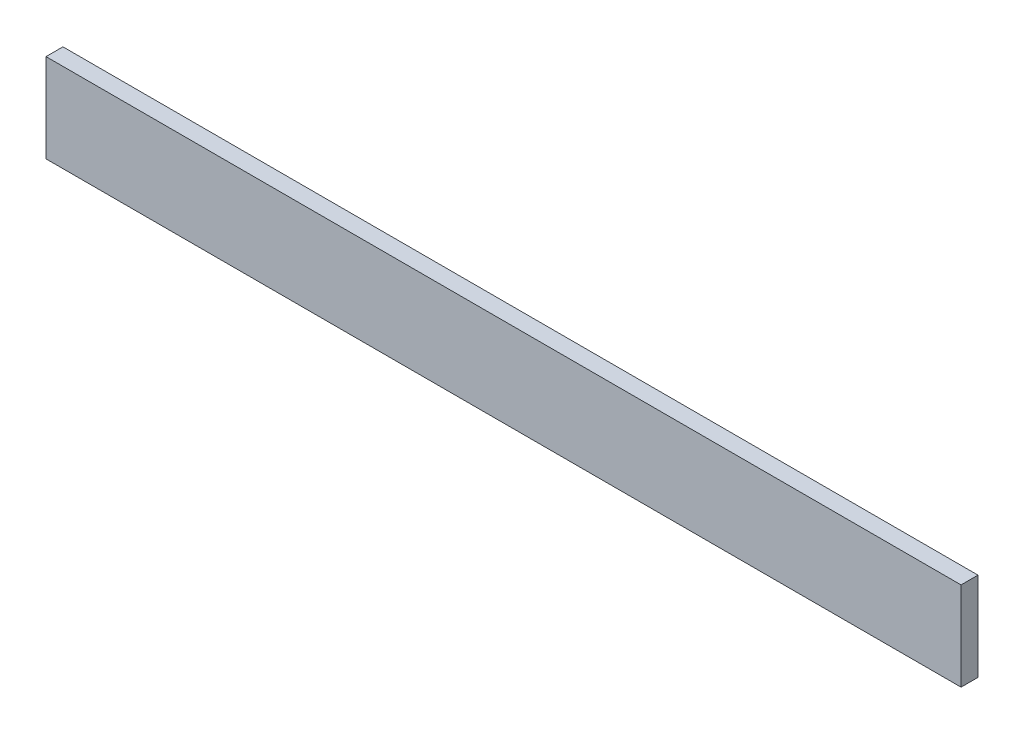
ISO-10303-21;
HEADER;
FILE_DESCRIPTION(('STEP AP214'),'2;1');
FILE_NAME('part.step','',(''),(''),'','','');
FILE_SCHEMA(('AUTOMOTIVE_DESIGN { 1 0 10303 214 1 1 1 1 }'));
ENDSEC;
DATA;
#1=APPLICATION_CONTEXT('core data for automotive mechanical design processes');
#2=APPLICATION_PROTOCOL_DEFINITION('international standard','automotive_design',2000,#1);
#3=PRODUCT_CONTEXT('',#1,'mechanical');
#4=PRODUCT('Part','Part','',(#3));
#5=PRODUCT_RELATED_PRODUCT_CATEGORY('part','',(#4));
#6=PRODUCT_DEFINITION_FORMATION('','',#4);
#7=PRODUCT_DEFINITION_CONTEXT('part definition',#1,'design');
#8=PRODUCT_DEFINITION('design','',#6,#7);
#9=PRODUCT_DEFINITION_SHAPE('','',#8);
#10=(LENGTH_UNIT() NAMED_UNIT(*) SI_UNIT(.MILLI.,.METRE.));
#11=(NAMED_UNIT(*) PLANE_ANGLE_UNIT() SI_UNIT($,.RADIAN.));
#12=(NAMED_UNIT(*) SI_UNIT($,.STERADIAN.) SOLID_ANGLE_UNIT());
#13=UNCERTAINTY_MEASURE_WITH_UNIT(LENGTH_MEASURE(1.E-05),#10,'distance_accuracy_value','');
#14=(GEOMETRIC_REPRESENTATION_CONTEXT(3) GLOBAL_UNCERTAINTY_ASSIGNED_CONTEXT((#13)) GLOBAL_UNIT_ASSIGNED_CONTEXT((#10,
#11,#12)) REPRESENTATION_CONTEXT('',''));
#15=CARTESIAN_POINT('',(0.,0.,0.));
#16=DIRECTION('',(0.,0.,1.));
#17=DIRECTION('',(1.,0.,0.));
#18=AXIS2_PLACEMENT_3D('',#15,#16,#17);
#19=CARTESIAN_POINT('',(171.507461858654,23.7112059296082,3.));
#20=DIRECTION('',(0.,-1.,0.));
#21=DIRECTION('',(0.,0.,-1.));
#22=AXIS2_PLACEMENT_3D('',#19,#20,#21);
#23=PLANE('',#22);
#24=DIRECTION('',(-1.,0.,0.));
#25=VECTOR('',#24,1.);
#26=CARTESIAN_POINT('',(171.507461858654,23.7112059296082,0.));
#27=LINE('',#26,#25);
#28=CARTESIAN_POINT('',(171.507461858654,23.7112059296082,0.));
#29=VERTEX_POINT('',#28);
#30=CARTESIAN_POINT('',(9.50746185865447,23.7112059296082,0.));
#31=VERTEX_POINT('',#30);
#32=EDGE_CURVE('E107',#29,#31,#27,.T.);
#33=ORIENTED_EDGE('',*,*,#32,.T.);
#34=DIRECTION('',(0.,0.,-1.));
#35=VECTOR('',#34,1.);
#36=CARTESIAN_POINT('',(9.50746185865447,23.7112059296082,3.));
#37=LINE('',#36,#35);
#38=CARTESIAN_POINT('',(9.50746185865447,23.7112059296082,3.));
#39=VERTEX_POINT('',#38);
#40=EDGE_CURVE('E11',#39,#31,#37,.T.);
#41=ORIENTED_EDGE('',*,*,#40,.F.);
#42=DIRECTION('',(-1.,0.,0.));
#43=VECTOR('',#42,1.);
#44=CARTESIAN_POINT('',(171.507461858654,23.7112059296082,3.));
#45=LINE('',#44,#43);
#46=CARTESIAN_POINT('',(171.507461858654,23.7112059296082,3.));
#47=VERTEX_POINT('',#46);
#48=EDGE_CURVE('E91',#47,#39,#45,.T.);
#49=ORIENTED_EDGE('',*,*,#48,.F.);
#50=DIRECTION('',(0.,0.,-1.));
#51=VECTOR('',#50,1.);
#52=CARTESIAN_POINT('',(171.507461858654,23.7112059296082,3.));
#53=LINE('',#52,#51);
#54=EDGE_CURVE('E103',#47,#29,#53,.T.);
#55=ORIENTED_EDGE('',*,*,#54,.T.);
#56=EDGE_LOOP('',(#33,#41,#49,#55));
#57=FACE_BOUND('',#56,.T.);
#58=ADVANCED_FACE('F39',(#57),#23,.F.);
#59=CARTESIAN_POINT('',(9.50746185865447,23.7112059296082,3.));
#60=DIRECTION('',(1.,0.,0.));
#61=DIRECTION('',(0.,0.,-1.));
#62=AXIS2_PLACEMENT_3D('',#59,#60,#61);
#63=PLANE('',#62);
#64=DIRECTION('',(0.,-1.,0.));
#65=VECTOR('',#64,1.);
#66=CARTESIAN_POINT('',(9.50746185865447,23.7112059296082,0.));
#67=LINE('',#66,#65);
#68=CARTESIAN_POINT('',(9.50746185865447,8.02846347687812,0.));
#69=VERTEX_POINT('',#68);
#70=EDGE_CURVE('E96',#31,#69,#67,.T.);
#71=ORIENTED_EDGE('',*,*,#70,.T.);
#72=DIRECTION('',(0.,0.,-1.));
#73=VECTOR('',#72,1.);
#74=CARTESIAN_POINT('',(9.50746185865447,8.02846347687812,3.));
#75=LINE('',#74,#73);
#76=CARTESIAN_POINT('',(9.50746185865447,8.02846347687812,3.));
#77=VERTEX_POINT('',#76);
#78=EDGE_CURVE('E48',#77,#69,#75,.T.);
#79=ORIENTED_EDGE('',*,*,#78,.F.);
#80=DIRECTION('',(0.,-1.,0.));
#81=VECTOR('',#80,1.);
#82=CARTESIAN_POINT('',(9.50746185865447,23.7112059296082,3.));
#83=LINE('',#82,#81);
#84=EDGE_CURVE('E86',#39,#77,#83,.T.);
#85=ORIENTED_EDGE('',*,*,#84,.F.);
#86=ORIENTED_EDGE('',*,*,#40,.T.);
#87=EDGE_LOOP('',(#71,#79,#85,#86));
#88=FACE_BOUND('',#87,.T.);
#89=ADVANCED_FACE('F95',(#88),#63,.F.);
#90=CARTESIAN_POINT('',(9.50746185865447,8.02846347687812,3.));
#91=DIRECTION('',(0.,1.,0.));
#92=DIRECTION('',(0.,0.,1.));
#93=AXIS2_PLACEMENT_3D('',#90,#91,#92);
#94=PLANE('',#93);
#95=DIRECTION('',(1.,0.,0.));
#96=VECTOR('',#95,1.);
#97=CARTESIAN_POINT('',(9.50746185865447,8.02846347687812,0.));
#98=LINE('',#97,#96);
#99=CARTESIAN_POINT('',(171.507461858654,8.02846347687812,0.));
#100=VERTEX_POINT('',#99);
#101=EDGE_CURVE('E73',#69,#100,#98,.T.);
#102=ORIENTED_EDGE('',*,*,#101,.T.);
#103=DIRECTION('',(0.,0.,-1.));
#104=VECTOR('',#103,1.);
#105=CARTESIAN_POINT('',(171.507461858654,8.02846347687812,3.));
#106=LINE('',#105,#104);
#107=CARTESIAN_POINT('',(171.507461858654,8.02846347687812,3.));
#108=VERTEX_POINT('',#107);
#109=EDGE_CURVE('E98',#108,#100,#106,.T.);
#110=ORIENTED_EDGE('',*,*,#109,.F.);
#111=DIRECTION('',(1.,0.,0.));
#112=VECTOR('',#111,1.);
#113=CARTESIAN_POINT('',(9.50746185865447,8.02846347687812,3.));
#114=LINE('',#113,#112);
#115=EDGE_CURVE('E89',#77,#108,#114,.T.);
#116=ORIENTED_EDGE('',*,*,#115,.F.);
#117=ORIENTED_EDGE('',*,*,#78,.T.);
#118=EDGE_LOOP('',(#102,#110,#116,#117));
#119=FACE_BOUND('',#118,.T.);
#120=ADVANCED_FACE('F99',(#119),#94,.F.);
#121=CARTESIAN_POINT('',(171.507461858654,8.02846347687812,3.));
#122=DIRECTION('',(-1.,0.,0.));
#123=DIRECTION('',(0.,0.,1.));
#124=AXIS2_PLACEMENT_3D('',#121,#122,#123);
#125=PLANE('',#124);
#126=DIRECTION('',(0.,1.,0.));
#127=VECTOR('',#126,1.);
#128=CARTESIAN_POINT('',(171.507461858654,8.02846347687812,0.));
#129=LINE('',#128,#127);
#130=EDGE_CURVE('E79',#100,#29,#129,.T.);
#131=ORIENTED_EDGE('',*,*,#130,.T.);
#132=ORIENTED_EDGE('',*,*,#54,.F.);
#133=DIRECTION('',(0.,1.,0.));
#134=VECTOR('',#133,1.);
#135=CARTESIAN_POINT('',(171.507461858654,8.02846347687812,3.));
#136=LINE('',#135,#134);
#137=EDGE_CURVE('E56',#108,#47,#136,.T.);
#138=ORIENTED_EDGE('',*,*,#137,.F.);
#139=ORIENTED_EDGE('',*,*,#109,.T.);
#140=EDGE_LOOP('',(#131,#132,#138,#139));
#141=FACE_BOUND('',#140,.T.);
#142=ADVANCED_FACE('F120',(#141),#125,.F.);
#143=CARTESIAN_POINT('',(0.,0.,3.));
#144=DIRECTION('',(0.,0.,1.));
#145=DIRECTION('',(1.,0.,0.));
#146=AXIS2_PLACEMENT_3D('',#143,#144,#145);
#147=PLANE('',#146);
#148=ORIENTED_EDGE('',*,*,#48,.T.);
#149=ORIENTED_EDGE('',*,*,#84,.T.);
#150=ORIENTED_EDGE('',*,*,#115,.T.);
#151=ORIENTED_EDGE('',*,*,#137,.T.);
#152=EDGE_LOOP('',(#148,#149,#150,#151));
#153=FACE_BOUND('',#152,.T.);
#154=ADVANCED_FACE('F87',(#153),#147,.T.);
#155=CARTESIAN_POINT('',(0.,0.,0.));
#156=DIRECTION('',(0.,0.,1.));
#157=DIRECTION('',(1.,0.,0.));
#158=AXIS2_PLACEMENT_3D('',#155,#156,#157);
#159=PLANE('',#158);
#160=ORIENTED_EDGE('',*,*,#32,.F.);
#161=ORIENTED_EDGE('',*,*,#130,.F.);
#162=ORIENTED_EDGE('',*,*,#101,.F.);
#163=ORIENTED_EDGE('',*,*,#70,.F.);
#164=EDGE_LOOP('',(#160,#161,#162,#163));
#165=FACE_BOUND('',#164,.T.);
#166=ADVANCED_FACE('F123',(#165),#159,.F.);
#167=CLOSED_SHELL('',(#58,#89,#120,#142,#154,#166));
#168=MANIFOLD_SOLID_BREP('B2',#167);
#169=ADVANCED_BREP_SHAPE_REPRESENTATION('',(#18,#168),#14);
#170=SHAPE_DEFINITION_REPRESENTATION(#9,#169);
ENDSEC;
END-ISO-10303-21;
